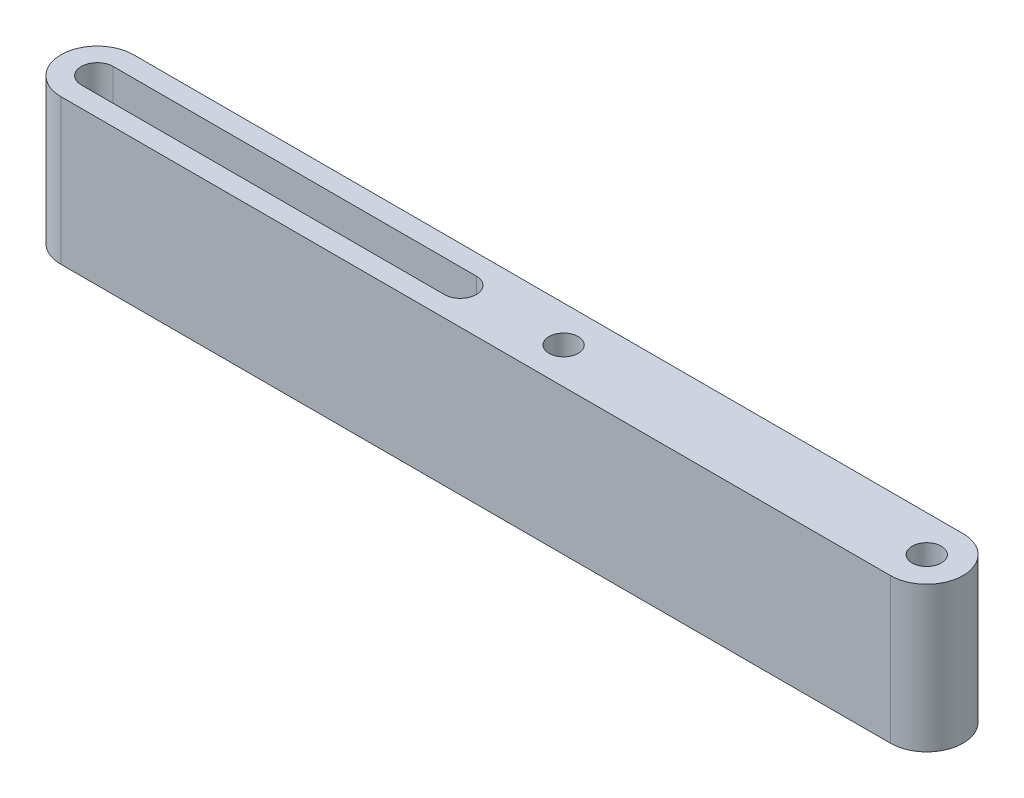
ISO-10303-21;
HEADER;
FILE_DESCRIPTION(('STEP AP214'),'2;1');
FILE_NAME('part.step','',(''),(''),'','','');
FILE_SCHEMA(('AUTOMOTIVE_DESIGN { 1 0 10303 214 1 1 1 1 }'));
ENDSEC;
DATA;
#1=APPLICATION_CONTEXT('core data for automotive mechanical design processes');
#2=APPLICATION_PROTOCOL_DEFINITION('international standard','automotive_design',2000,#1);
#3=PRODUCT_CONTEXT('',#1,'mechanical');
#4=PRODUCT('Part','Part','',(#3));
#5=PRODUCT_RELATED_PRODUCT_CATEGORY('part','',(#4));
#6=PRODUCT_DEFINITION_FORMATION('','',#4);
#7=PRODUCT_DEFINITION_CONTEXT('part definition',#1,'design');
#8=PRODUCT_DEFINITION('design','',#6,#7);
#9=PRODUCT_DEFINITION_SHAPE('','',#8);
#10=(LENGTH_UNIT() NAMED_UNIT(*) SI_UNIT(.MILLI.,.METRE.));
#11=(NAMED_UNIT(*) PLANE_ANGLE_UNIT() SI_UNIT($,.RADIAN.));
#12=(NAMED_UNIT(*) SI_UNIT($,.STERADIAN.) SOLID_ANGLE_UNIT());
#13=UNCERTAINTY_MEASURE_WITH_UNIT(LENGTH_MEASURE(1.E-05),#10,'distance_accuracy_value','');
#14=(GEOMETRIC_REPRESENTATION_CONTEXT(3) GLOBAL_UNCERTAINTY_ASSIGNED_CONTEXT((#13)) GLOBAL_UNIT_ASSIGNED_CONTEXT((#10,
#11,#12)) REPRESENTATION_CONTEXT('',''));
#15=CARTESIAN_POINT('',(0.,0.,0.));
#16=DIRECTION('',(0.,0.,1.));
#17=DIRECTION('',(1.,0.,0.));
#18=AXIS2_PLACEMENT_3D('',#15,#16,#17);
#19=CARTESIAN_POINT('',(-31.75,170.972296099361,44.45));
#20=DIRECTION('',(0.,-1.,0.));
#21=DIRECTION('',(0.,0.,-1.));
#22=AXIS2_PLACEMENT_3D('',#19,#20,#21);
#23=CYLINDRICAL_SURFACE('',#22,2.55270000000003);
#24=CARTESIAN_POINT('',(-31.75,-12.7,44.45));
#25=DIRECTION('',(0.,1.,0.));
#26=DIRECTION('',(0.,0.,1.));
#27=AXIS2_PLACEMENT_3D('',#24,#25,#26);
#28=CIRCLE('',#27,2.55270000000003);
#29=CARTESIAN_POINT('',(-31.75,-12.7,41.8973));
#30=VERTEX_POINT('',#29);
#31=EDGE_CURVE('E179',#30,#30,#28,.T.);
#32=CARTESIAN_POINT('',(-31.75,12.7,44.45));
#33=DIRECTION('',(0.,1.,0.));
#34=DIRECTION('',(0.,0.,1.));
#35=AXIS2_PLACEMENT_3D('',#32,#33,#34);
#36=CIRCLE('',#35,2.55270000000003);
#37=CARTESIAN_POINT('',(-31.75,12.7,41.8973));
#38=VERTEX_POINT('',#37);
#39=EDGE_CURVE('E110',#38,#38,#36,.T.);
#40=CARTESIAN_POINT('',(-31.75,-12.7,41.8973));
#41=CARTESIAN_POINT('',(-31.75,-12.4354166666667,41.8973));
#42=CARTESIAN_POINT('',(-31.75,-12.1708333333333,41.8973));
#43=CARTESIAN_POINT('',(-31.75,-11.6416666666667,41.8973));
#44=CARTESIAN_POINT('',(-31.75,-11.3770833333333,41.8973));
#45=CARTESIAN_POINT('',(-31.75,-10.8479166666667,41.8973));
#46=CARTESIAN_POINT('',(-31.75,-10.5833333333333,41.8973));
#47=CARTESIAN_POINT('',(-31.75,-10.0541666666667,41.8973));
#48=CARTESIAN_POINT('',(-31.75,-9.78958333333333,41.8973));
#49=CARTESIAN_POINT('',(-31.75,-9.26041666666667,41.8973));
#50=CARTESIAN_POINT('',(-31.75,-8.99583333333333,41.8973));
#51=CARTESIAN_POINT('',(-31.75,-8.46666666666666,41.8973));
#52=CARTESIAN_POINT('',(-31.75,-8.20208333333332,41.8973));
#53=CARTESIAN_POINT('',(-31.75,-7.67291666666666,41.8973));
#54=CARTESIAN_POINT('',(-31.75,-7.40833333333333,41.8973));
#55=CARTESIAN_POINT('',(-31.75,-6.87916666666667,41.8973));
#56=CARTESIAN_POINT('',(-31.75,-6.61458333333333,41.8973));
#57=CARTESIAN_POINT('',(-31.75,-6.08541666666666,41.8973));
#58=CARTESIAN_POINT('',(-31.75,-5.82083333333332,41.8973));
#59=CARTESIAN_POINT('',(-31.75,-5.29166666666666,41.8973));
#60=CARTESIAN_POINT('',(-31.75,-5.02708333333333,41.8973));
#61=CARTESIAN_POINT('',(-31.75,-4.49791666666667,41.8973));
#62=CARTESIAN_POINT('',(-31.75,-4.23333333333333,41.8973));
#63=CARTESIAN_POINT('',(-31.75,-3.70416666666666,41.8973));
#64=CARTESIAN_POINT('',(-31.75,-3.43958333333332,41.8973));
#65=CARTESIAN_POINT('',(-31.75,-2.91041666666666,41.8973));
#66=CARTESIAN_POINT('',(-31.75,-2.64583333333333,41.8973));
#67=CARTESIAN_POINT('',(-31.75,-2.11666666666666,41.8973));
#68=CARTESIAN_POINT('',(-31.75,-1.85208333333333,41.8973));
#69=CARTESIAN_POINT('',(-31.75,-1.32291666666666,41.8973));
#70=CARTESIAN_POINT('',(-31.75,-1.05833333333334,41.8973));
#71=CARTESIAN_POINT('',(-31.75,-0.529166666666673,41.8973));
#72=CARTESIAN_POINT('',(-31.75,-0.264583333333337,41.8973));
#73=CARTESIAN_POINT('',(-31.75,0.264583333333337,41.8973));
#74=CARTESIAN_POINT('',(-31.75,0.529166666666673,41.8973));
#75=CARTESIAN_POINT('',(-31.75,1.05833333333334,41.8973));
#76=CARTESIAN_POINT('',(-31.75,1.32291666666666,41.8973));
#77=CARTESIAN_POINT('',(-31.75,1.85208333333333,41.8973));
#78=CARTESIAN_POINT('',(-31.75,2.11666666666666,41.8973));
#79=CARTESIAN_POINT('',(-31.75,2.64583333333333,41.8973));
#80=CARTESIAN_POINT('',(-31.75,2.91041666666666,41.8973));
#81=CARTESIAN_POINT('',(-31.75,3.43958333333332,41.8973));
#82=CARTESIAN_POINT('',(-31.75,3.70416666666666,41.8973));
#83=CARTESIAN_POINT('',(-31.75,4.23333333333333,41.8973));
#84=CARTESIAN_POINT('',(-31.75,4.49791666666667,41.8973));
#85=CARTESIAN_POINT('',(-31.75,5.02708333333333,41.8973));
#86=CARTESIAN_POINT('',(-31.75,5.29166666666666,41.8973));
#87=CARTESIAN_POINT('',(-31.75,5.82083333333332,41.8973));
#88=CARTESIAN_POINT('',(-31.75,6.08541666666666,41.8973));
#89=CARTESIAN_POINT('',(-31.75,6.61458333333333,41.8973));
#90=CARTESIAN_POINT('',(-31.75,6.87916666666667,41.8973));
#91=CARTESIAN_POINT('',(-31.75,7.40833333333333,41.8973));
#92=CARTESIAN_POINT('',(-31.75,7.67291666666666,41.8973));
#93=CARTESIAN_POINT('',(-31.75,8.20208333333332,41.8973));
#94=CARTESIAN_POINT('',(-31.75,8.46666666666666,41.8973));
#95=CARTESIAN_POINT('',(-31.75,8.99583333333333,41.8973));
#96=CARTESIAN_POINT('',(-31.75,9.26041666666667,41.8973));
#97=CARTESIAN_POINT('',(-31.75,9.78958333333333,41.8973));
#98=CARTESIAN_POINT('',(-31.75,10.0541666666667,41.8973));
#99=CARTESIAN_POINT('',(-31.75,10.5833333333333,41.8973));
#100=CARTESIAN_POINT('',(-31.75,10.8479166666667,41.8973));
#101=CARTESIAN_POINT('',(-31.75,11.3770833333333,41.8973));
#102=CARTESIAN_POINT('',(-31.75,11.6416666666667,41.8973));
#103=CARTESIAN_POINT('',(-31.75,12.1708333333333,41.8973));
#104=CARTESIAN_POINT('',(-31.75,12.4354166666667,41.8973));
#105=CARTESIAN_POINT('',(-31.75,12.7,41.8973));
#106=B_SPLINE_CURVE_WITH_KNOTS('',3,(#40,#41,#42,#43,#44,#45,#46,#47,#48,#49,#50,#51,#52,#53,
#54,#55,#56,#57,#58,#59,#60,#61,#62,#63,#64,#65,#66,#67,#68,#69,#70,#71,#72,#73,#74,#75,#76,#77,
#78,#79,#80,#81,#82,#83,#84,#85,#86,#87,#88,#89,#90,#91,#92,#93,#94,#95,#96,#97,#98,#99,#100,
#101,#102,#103,#104,#105),.UNSPECIFIED.,.F.,.F.,(4,2,2,2,2,2,2,2,2,2,2,2,2,2,2,2,2,2,2,2,2,2,2,
2,2,2,2,2,2,2,2,2,4),(0.,0.79375000000001,1.58749999999999,2.38125,3.17499999999998,
3.96874999999999,4.7625,5.55624999999998,6.34999999999999,7.14375,7.93749999999999,8.73125,
9.52500000000001,10.31875,11.1125,11.90625,12.7,13.49375,14.2875,15.08125,15.875,16.66875,
17.4625,18.25625,19.05,19.84375,20.6375,21.43125,22.225,23.01875,23.8125,24.60625,25.4),.UNSPECIFIED.);
#107=EDGE_CURVE('BSEAM39',#30,#38,#106,.T.);
#108=ORIENTED_EDGE('',*,*,#31,.F.);
#109=ORIENTED_EDGE('',*,*,#39,.T.);
#110=ORIENTED_EDGE('',*,*,#107,.T.);
#111=ORIENTED_EDGE('',*,*,#107,.F.);
#112=EDGE_LOOP('',(#108,#110,#109,#111));
#113=FACE_BOUND('',#112,.T.);
#114=ADVANCED_FACE('F39',(#113),#23,.F.);
#115=CARTESIAN_POINT('',(-49.81194,170.972296099361,47.244));
#116=DIRECTION('',(0.,0.,-1.));
#117=DIRECTION('',(-1.,0.,0.));
#118=AXIS2_PLACEMENT_3D('',#115,#116,#117);
#119=PLANE('',#118);
#120=DIRECTION('',(0.,-1.,0.));
#121=VECTOR('',#120,1.);
#122=CARTESIAN_POINT('',(-113.31194,170.972296099361,47.244));
#123=LINE('',#122,#121);
#124=CARTESIAN_POINT('',(-113.31194,12.7,47.244));
#125=VERTEX_POINT('',#124);
#126=CARTESIAN_POINT('',(-113.31194,-12.7,47.244));
#127=VERTEX_POINT('',#126);
#128=EDGE_CURVE('E115',#125,#127,#123,.T.);
#129=ORIENTED_EDGE('',*,*,#128,.F.);
#130=DIRECTION('',(1.,0.,0.));
#131=VECTOR('',#130,1.);
#132=CARTESIAN_POINT('',(-49.81194,12.7,47.244));
#133=LINE('',#132,#131);
#134=CARTESIAN_POINT('',(-49.81194,12.7,47.244));
#135=VERTEX_POINT('',#134);
#136=EDGE_CURVE('E102',#125,#135,#133,.T.);
#137=ORIENTED_EDGE('',*,*,#136,.T.);
#138=DIRECTION('',(0.,-1.,0.));
#139=VECTOR('',#138,1.);
#140=CARTESIAN_POINT('',(-49.81194,170.972296099361,47.244));
#141=LINE('',#140,#139);
#142=CARTESIAN_POINT('',(-49.81194,-12.7,47.244));
#143=VERTEX_POINT('',#142);
#144=EDGE_CURVE('E125',#135,#143,#141,.T.);
#145=ORIENTED_EDGE('',*,*,#144,.T.);
#146=DIRECTION('',(1.,0.,0.));
#147=VECTOR('',#146,1.);
#148=CARTESIAN_POINT('',(-49.81194,-12.7,47.244));
#149=LINE('',#148,#147);
#150=EDGE_CURVE('E123',#127,#143,#149,.T.);
#151=ORIENTED_EDGE('',*,*,#150,.F.);
#152=EDGE_LOOP('',(#129,#137,#145,#151));
#153=FACE_BOUND('',#152,.T.);
#154=ADVANCED_FACE('F121',(#153),#119,.T.);
#155=CARTESIAN_POINT('',(-113.31194,170.972296099361,44.45));
#156=DIRECTION('',(0.,-1.,0.));
#157=DIRECTION('',(0.,0.,-1.));
#158=AXIS2_PLACEMENT_3D('',#155,#156,#157);
#159=CYLINDRICAL_SURFACE('',#158,2.79400000000001);
#160=DIRECTION('',(0.,-1.,0.));
#161=VECTOR('',#160,1.);
#162=CARTESIAN_POINT('',(-113.31194,170.972296099361,41.656));
#163=LINE('',#162,#161);
#164=CARTESIAN_POINT('',(-113.31194,12.7,41.656));
#165=VERTEX_POINT('',#164);
#166=CARTESIAN_POINT('',(-113.31194,-12.7,41.656));
#167=VERTEX_POINT('',#166);
#168=EDGE_CURVE('E117',#165,#167,#163,.T.);
#169=ORIENTED_EDGE('',*,*,#168,.F.);
#170=CARTESIAN_POINT('',(-113.31194,12.7,44.45));
#171=DIRECTION('',(0.,1.,0.));
#172=DIRECTION('',(0.,0.,1.));
#173=AXIS2_PLACEMENT_3D('',#170,#171,#172);
#174=CIRCLE('',#173,2.79400000000001);
#175=EDGE_CURVE('E106',#165,#125,#174,.T.);
#176=ORIENTED_EDGE('',*,*,#175,.T.);
#177=ORIENTED_EDGE('',*,*,#128,.T.);
#178=CARTESIAN_POINT('',(-113.31194,-12.7,44.45));
#179=DIRECTION('',(0.,1.,0.));
#180=DIRECTION('',(0.,0.,1.));
#181=AXIS2_PLACEMENT_3D('',#178,#179,#180);
#182=CIRCLE('',#181,2.79400000000001);
#183=EDGE_CURVE('E188',#167,#127,#182,.T.);
#184=ORIENTED_EDGE('',*,*,#183,.F.);
#185=EDGE_LOOP('',(#169,#176,#177,#184));
#186=FACE_BOUND('',#185,.T.);
#187=ADVANCED_FACE('F113',(#186),#159,.F.);
#188=CARTESIAN_POINT('',(-49.81194,170.972296099361,41.656));
#189=DIRECTION('',(0.,0.,1.));
#190=DIRECTION('',(1.,0.,0.));
#191=AXIS2_PLACEMENT_3D('',#188,#189,#190);
#192=PLANE('',#191);
#193=DIRECTION('',(0.,-1.,0.));
#194=VECTOR('',#193,1.);
#195=CARTESIAN_POINT('',(-49.81194,170.972296099361,41.656));
#196=LINE('',#195,#194);
#197=CARTESIAN_POINT('',(-49.81194,12.7,41.656));
#198=VERTEX_POINT('',#197);
#199=CARTESIAN_POINT('',(-49.81194,-12.7,41.656));
#200=VERTEX_POINT('',#199);
#201=EDGE_CURVE('E127',#198,#200,#196,.T.);
#202=ORIENTED_EDGE('',*,*,#201,.F.);
#203=DIRECTION('',(-1.,0.,0.));
#204=VECTOR('',#203,1.);
#205=CARTESIAN_POINT('',(-49.81194,12.7,41.656));
#206=LINE('',#205,#204);
#207=EDGE_CURVE('E119',#198,#165,#206,.T.);
#208=ORIENTED_EDGE('',*,*,#207,.T.);
#209=ORIENTED_EDGE('',*,*,#168,.T.);
#210=DIRECTION('',(-1.,0.,0.));
#211=VECTOR('',#210,1.);
#212=CARTESIAN_POINT('',(-49.81194,-12.7,41.656));
#213=LINE('',#212,#211);
#214=EDGE_CURVE('E185',#200,#167,#213,.T.);
#215=ORIENTED_EDGE('',*,*,#214,.F.);
#216=EDGE_LOOP('',(#202,#208,#209,#215));
#217=FACE_BOUND('',#216,.T.);
#218=ADVANCED_FACE('F194',(#217),#192,.T.);
#219=CARTESIAN_POINT('',(-49.81194,170.972296099361,44.45));
#220=DIRECTION('',(0.,-1.,0.));
#221=DIRECTION('',(0.,0.,-1.));
#222=AXIS2_PLACEMENT_3D('',#219,#220,#221);
#223=CYLINDRICAL_SURFACE('',#222,2.794);
#224=ORIENTED_EDGE('',*,*,#144,.F.);
#225=CARTESIAN_POINT('',(-49.81194,12.7,44.45));
#226=DIRECTION('',(0.,1.,0.));
#227=DIRECTION('',(0.,0.,1.));
#228=AXIS2_PLACEMENT_3D('',#225,#226,#227);
#229=CIRCLE('',#228,2.794);
#230=EDGE_CURVE('E63',#135,#198,#229,.T.);
#231=ORIENTED_EDGE('',*,*,#230,.T.);
#232=ORIENTED_EDGE('',*,*,#201,.T.);
#233=CARTESIAN_POINT('',(-49.81194,-12.7,44.45));
#234=DIRECTION('',(0.,1.,0.));
#235=DIRECTION('',(0.,0.,1.));
#236=AXIS2_PLACEMENT_3D('',#233,#234,#235);
#237=CIRCLE('',#236,2.794);
#238=EDGE_CURVE('E182',#143,#200,#237,.T.);
#239=ORIENTED_EDGE('',*,*,#238,.F.);
#240=EDGE_LOOP('',(#224,#231,#232,#239));
#241=FACE_BOUND('',#240,.T.);
#242=ADVANCED_FACE('F226',(#241),#223,.F.);
#243=CARTESIAN_POINT('',(31.75,170.972296099361,50.8));
#244=DIRECTION('',(0.,0.,-1.));
#245=DIRECTION('',(-1.,0.,0.));
#246=AXIS2_PLACEMENT_3D('',#243,#244,#245);
#247=PLANE('',#246);
#248=DIRECTION('',(1.,0.,0.));
#249=VECTOR('',#248,1.);
#250=CARTESIAN_POINT('',(31.75,12.7,50.8));
#251=LINE('',#250,#249);
#252=CARTESIAN_POINT('',(-113.31194,12.7,50.8000000000001));
#253=VERTEX_POINT('',#252);
#254=CARTESIAN_POINT('',(31.75,12.7,50.8));
#255=VERTEX_POINT('',#254);
#256=EDGE_CURVE('E166',#253,#255,#251,.T.);
#257=ORIENTED_EDGE('',*,*,#256,.F.);
#258=DIRECTION('',(0.,-1.,0.));
#259=VECTOR('',#258,1.);
#260=CARTESIAN_POINT('',(-113.31194,170.972296099361,50.8000000000001));
#261=LINE('',#260,#259);
#262=CARTESIAN_POINT('',(-113.31194,-12.7,50.8000000000001));
#263=VERTEX_POINT('',#262);
#264=EDGE_CURVE('E55',#253,#263,#261,.T.);
#265=ORIENTED_EDGE('',*,*,#264,.T.);
#266=DIRECTION('',(1.,0.,0.));
#267=VECTOR('',#266,1.);
#268=CARTESIAN_POINT('',(31.75,-12.7,50.8));
#269=LINE('',#268,#267);
#270=CARTESIAN_POINT('',(31.75,-12.7,50.8));
#271=VERTEX_POINT('',#270);
#272=EDGE_CURVE('E141',#263,#271,#269,.T.);
#273=ORIENTED_EDGE('',*,*,#272,.T.);
#274=DIRECTION('',(0.,-1.,0.));
#275=VECTOR('',#274,1.);
#276=CARTESIAN_POINT('',(31.75,170.972296099361,50.8));
#277=LINE('',#276,#275);
#278=EDGE_CURVE('E144',#255,#271,#277,.T.);
#279=ORIENTED_EDGE('',*,*,#278,.F.);
#280=EDGE_LOOP('',(#257,#265,#273,#279));
#281=FACE_BOUND('',#280,.T.);
#282=ADVANCED_FACE('F163',(#281),#247,.F.);
#283=CARTESIAN_POINT('',(-113.31194,170.972296099361,44.45));
#284=DIRECTION('',(0.,-1.,0.));
#285=DIRECTION('',(0.,0.,-1.));
#286=AXIS2_PLACEMENT_3D('',#283,#284,#285);
#287=CYLINDRICAL_SURFACE('',#286,6.35000000000004);
#288=CARTESIAN_POINT('',(-113.31194,12.7,44.45));
#289=DIRECTION('',(0.,1.,0.));
#290=DIRECTION('',(0.,0.,1.));
#291=AXIS2_PLACEMENT_3D('',#288,#289,#290);
#292=CIRCLE('',#291,6.35000000000004);
#293=CARTESIAN_POINT('',(-113.31194,12.7,38.1));
#294=VERTEX_POINT('',#293);
#295=EDGE_CURVE('E152',#294,#253,#292,.T.);
#296=ORIENTED_EDGE('',*,*,#295,.F.);
#297=DIRECTION('',(0.,-1.,0.));
#298=VECTOR('',#297,1.);
#299=CARTESIAN_POINT('',(-113.31194,170.972296099361,38.1));
#300=LINE('',#299,#298);
#301=CARTESIAN_POINT('',(-113.31194,-12.7,38.1));
#302=VERTEX_POINT('',#301);
#303=EDGE_CURVE('E48',#294,#302,#300,.T.);
#304=ORIENTED_EDGE('',*,*,#303,.T.);
#305=CARTESIAN_POINT('',(-113.31194,-12.7,44.45));
#306=DIRECTION('',(0.,1.,0.));
#307=DIRECTION('',(0.,0.,1.));
#308=AXIS2_PLACEMENT_3D('',#305,#306,#307);
#309=CIRCLE('',#308,6.35000000000004);
#310=EDGE_CURVE('E139',#302,#263,#309,.T.);
#311=ORIENTED_EDGE('',*,*,#310,.T.);
#312=ORIENTED_EDGE('',*,*,#264,.F.);
#313=EDGE_LOOP('',(#296,#304,#311,#312));
#314=FACE_BOUND('',#313,.T.);
#315=ADVANCED_FACE('F148',(#314),#287,.T.);
#316=CARTESIAN_POINT('',(31.75,170.972296099361,38.1));
#317=DIRECTION('',(0.,0.,1.));
#318=DIRECTION('',(1.,0.,0.));
#319=AXIS2_PLACEMENT_3D('',#316,#317,#318);
#320=PLANE('',#319);
#321=DIRECTION('',(-1.,0.,0.));
#322=VECTOR('',#321,1.);
#323=CARTESIAN_POINT('',(31.75,12.7,38.1));
#324=LINE('',#323,#322);
#325=CARTESIAN_POINT('',(31.75,12.7,38.1));
#326=VERTEX_POINT('',#325);
#327=EDGE_CURVE('E169',#326,#294,#324,.T.);
#328=ORIENTED_EDGE('',*,*,#327,.F.);
#329=DIRECTION('',(0.,-1.,0.));
#330=VECTOR('',#329,1.);
#331=CARTESIAN_POINT('',(31.75,170.972296099361,38.1));
#332=LINE('',#331,#330);
#333=CARTESIAN_POINT('',(31.75,-12.7,38.1));
#334=VERTEX_POINT('',#333);
#335=EDGE_CURVE('E11',#326,#334,#332,.T.);
#336=ORIENTED_EDGE('',*,*,#335,.T.);
#337=DIRECTION('',(-1.,0.,0.));
#338=VECTOR('',#337,1.);
#339=CARTESIAN_POINT('',(31.75,-12.7,38.1));
#340=LINE('',#339,#338);
#341=EDGE_CURVE('E136',#334,#302,#340,.T.);
#342=ORIENTED_EDGE('',*,*,#341,.T.);
#343=ORIENTED_EDGE('',*,*,#303,.F.);
#344=EDGE_LOOP('',(#328,#336,#342,#343));
#345=FACE_BOUND('',#344,.T.);
#346=ADVANCED_FACE('F156',(#345),#320,.F.);
#347=CARTESIAN_POINT('',(31.75,170.972296099361,44.45));
#348=DIRECTION('',(0.,-1.,0.));
#349=DIRECTION('',(0.,0.,-1.));
#350=AXIS2_PLACEMENT_3D('',#347,#348,#349);
#351=CYLINDRICAL_SURFACE('',#350,6.35000000000003);
#352=CARTESIAN_POINT('',(31.75,12.7,44.45));
#353=DIRECTION('',(0.,1.,0.));
#354=DIRECTION('',(0.,0.,1.));
#355=AXIS2_PLACEMENT_3D('',#352,#353,#354);
#356=CIRCLE('',#355,6.35000000000003);
#357=EDGE_CURVE('E171',#255,#326,#356,.T.);
#358=ORIENTED_EDGE('',*,*,#357,.F.);
#359=ORIENTED_EDGE('',*,*,#278,.T.);
#360=CARTESIAN_POINT('',(31.75,-12.7,44.45));
#361=DIRECTION('',(0.,1.,0.));
#362=DIRECTION('',(0.,0.,1.));
#363=AXIS2_PLACEMENT_3D('',#360,#361,#362);
#364=CIRCLE('',#363,6.35000000000003);
#365=EDGE_CURVE('E133',#271,#334,#364,.T.);
#366=ORIENTED_EDGE('',*,*,#365,.T.);
#367=ORIENTED_EDGE('',*,*,#335,.F.);
#368=EDGE_LOOP('',(#358,#359,#366,#367));
#369=FACE_BOUND('',#368,.T.);
#370=ADVANCED_FACE('F41',(#369),#351,.T.);
#371=CARTESIAN_POINT('',(31.75,-12.7,44.45));
#372=DIRECTION('',(0.,1.,0.));
#373=DIRECTION('',(0.,0.,1.));
#374=AXIS2_PLACEMENT_3D('',#371,#372,#373);
#375=PLANE('',#374);
#376=ORIENTED_EDGE('',*,*,#365,.F.);
#377=ORIENTED_EDGE('',*,*,#272,.F.);
#378=ORIENTED_EDGE('',*,*,#310,.F.);
#379=ORIENTED_EDGE('',*,*,#341,.F.);
#380=EDGE_LOOP('',(#376,#377,#378,#379));
#381=FACE_BOUND('',#380,.T.);
#382=ORIENTED_EDGE('',*,*,#238,.T.);
#383=ORIENTED_EDGE('',*,*,#214,.T.);
#384=ORIENTED_EDGE('',*,*,#183,.T.);
#385=ORIENTED_EDGE('',*,*,#150,.T.);
#386=EDGE_LOOP('',(#382,#383,#384,#385));
#387=FACE_BOUND('',#386,.T.);
#388=ORIENTED_EDGE('',*,*,#31,.T.);
#389=EDGE_LOOP('',(#388));
#390=FACE_BOUND('',#389,.T.);
#391=CARTESIAN_POINT('',(31.75,-12.7,44.45));
#392=DIRECTION('',(0.,1.,0.));
#393=DIRECTION('',(0.,0.,1.));
#394=AXIS2_PLACEMENT_3D('',#391,#392,#393);
#395=CIRCLE('',#394,2.5527);
#396=CARTESIAN_POINT('',(31.75,-12.7,41.8973));
#397=VERTEX_POINT('',#396);
#398=EDGE_CURVE('E176',#397,#397,#395,.T.);
#399=ORIENTED_EDGE('',*,*,#398,.T.);
#400=EDGE_LOOP('',(#399));
#401=FACE_BOUND('',#400,.T.);
#402=ADVANCED_FACE('F160',(#381,#387,#390,#401),#375,.F.);
#403=CARTESIAN_POINT('',(31.75,170.972296099361,44.45));
#404=DIRECTION('',(0.,-1.,0.));
#405=DIRECTION('',(0.,0.,-1.));
#406=AXIS2_PLACEMENT_3D('',#403,#404,#405);
#407=CYLINDRICAL_SURFACE('',#406,2.5527);
#408=CARTESIAN_POINT('',(31.75,12.7,44.45));
#409=DIRECTION('',(0.,1.,0.));
#410=DIRECTION('',(0.,0.,1.));
#411=AXIS2_PLACEMENT_3D('',#408,#409,#410);
#412=CIRCLE('',#411,2.5527);
#413=CARTESIAN_POINT('',(31.75,12.7,41.8973));
#414=VERTEX_POINT('',#413);
#415=EDGE_CURVE('E43',#414,#414,#412,.T.);
#416=CARTESIAN_POINT('',(31.75,-12.7,41.8973));
#417=CARTESIAN_POINT('',(31.75,-12.4354166666667,41.8973));
#418=CARTESIAN_POINT('',(31.75,-12.1708333333333,41.8973));
#419=CARTESIAN_POINT('',(31.75,-11.6416666666667,41.8973));
#420=CARTESIAN_POINT('',(31.75,-11.3770833333333,41.8973));
#421=CARTESIAN_POINT('',(31.75,-10.8479166666667,41.8973));
#422=CARTESIAN_POINT('',(31.75,-10.5833333333333,41.8973));
#423=CARTESIAN_POINT('',(31.75,-10.0541666666667,41.8973));
#424=CARTESIAN_POINT('',(31.75,-9.78958333333333,41.8973));
#425=CARTESIAN_POINT('',(31.75,-9.26041666666667,41.8973));
#426=CARTESIAN_POINT('',(31.75,-8.99583333333333,41.8973));
#427=CARTESIAN_POINT('',(31.75,-8.46666666666666,41.8973));
#428=CARTESIAN_POINT('',(31.75,-8.20208333333332,41.8973));
#429=CARTESIAN_POINT('',(31.75,-7.67291666666666,41.8973));
#430=CARTESIAN_POINT('',(31.75,-7.40833333333333,41.8973));
#431=CARTESIAN_POINT('',(31.75,-6.87916666666667,41.8973));
#432=CARTESIAN_POINT('',(31.75,-6.61458333333333,41.8973));
#433=CARTESIAN_POINT('',(31.75,-6.08541666666666,41.8973));
#434=CARTESIAN_POINT('',(31.75,-5.82083333333332,41.8973));
#435=CARTESIAN_POINT('',(31.75,-5.29166666666666,41.8973));
#436=CARTESIAN_POINT('',(31.75,-5.02708333333333,41.8973));
#437=CARTESIAN_POINT('',(31.75,-4.49791666666667,41.8973));
#438=CARTESIAN_POINT('',(31.75,-4.23333333333333,41.8973));
#439=CARTESIAN_POINT('',(31.75,-3.70416666666666,41.8973));
#440=CARTESIAN_POINT('',(31.75,-3.43958333333332,41.8973));
#441=CARTESIAN_POINT('',(31.75,-2.91041666666666,41.8973));
#442=CARTESIAN_POINT('',(31.75,-2.64583333333333,41.8973));
#443=CARTESIAN_POINT('',(31.75,-2.11666666666666,41.8973));
#444=CARTESIAN_POINT('',(31.75,-1.85208333333333,41.8973));
#445=CARTESIAN_POINT('',(31.75,-1.32291666666666,41.8973));
#446=CARTESIAN_POINT('',(31.75,-1.05833333333334,41.8973));
#447=CARTESIAN_POINT('',(31.75,-0.529166666666673,41.8973));
#448=CARTESIAN_POINT('',(31.75,-0.264583333333337,41.8973));
#449=CARTESIAN_POINT('',(31.75,0.264583333333337,41.8973));
#450=CARTESIAN_POINT('',(31.75,0.529166666666673,41.8973));
#451=CARTESIAN_POINT('',(31.75,1.05833333333334,41.8973));
#452=CARTESIAN_POINT('',(31.75,1.32291666666666,41.8973));
#453=CARTESIAN_POINT('',(31.75,1.85208333333333,41.8973));
#454=CARTESIAN_POINT('',(31.75,2.11666666666666,41.8973));
#455=CARTESIAN_POINT('',(31.75,2.64583333333333,41.8973));
#456=CARTESIAN_POINT('',(31.75,2.91041666666666,41.8973));
#457=CARTESIAN_POINT('',(31.75,3.43958333333332,41.8973));
#458=CARTESIAN_POINT('',(31.75,3.70416666666666,41.8973));
#459=CARTESIAN_POINT('',(31.75,4.23333333333333,41.8973));
#460=CARTESIAN_POINT('',(31.75,4.49791666666667,41.8973));
#461=CARTESIAN_POINT('',(31.75,5.02708333333333,41.8973));
#462=CARTESIAN_POINT('',(31.75,5.29166666666666,41.8973));
#463=CARTESIAN_POINT('',(31.75,5.82083333333332,41.8973));
#464=CARTESIAN_POINT('',(31.75,6.08541666666666,41.8973));
#465=CARTESIAN_POINT('',(31.75,6.61458333333333,41.8973));
#466=CARTESIAN_POINT('',(31.75,6.87916666666667,41.8973));
#467=CARTESIAN_POINT('',(31.75,7.40833333333333,41.8973));
#468=CARTESIAN_POINT('',(31.75,7.67291666666666,41.8973));
#469=CARTESIAN_POINT('',(31.75,8.20208333333332,41.8973));
#470=CARTESIAN_POINT('',(31.75,8.46666666666666,41.8973));
#471=CARTESIAN_POINT('',(31.75,8.99583333333333,41.8973));
#472=CARTESIAN_POINT('',(31.75,9.26041666666667,41.8973));
#473=CARTESIAN_POINT('',(31.75,9.78958333333333,41.8973));
#474=CARTESIAN_POINT('',(31.75,10.0541666666667,41.8973));
#475=CARTESIAN_POINT('',(31.75,10.5833333333333,41.8973));
#476=CARTESIAN_POINT('',(31.75,10.8479166666667,41.8973));
#477=CARTESIAN_POINT('',(31.75,11.3770833333333,41.8973));
#478=CARTESIAN_POINT('',(31.75,11.6416666666667,41.8973));
#479=CARTESIAN_POINT('',(31.75,12.1708333333333,41.8973));
#480=CARTESIAN_POINT('',(31.75,12.4354166666667,41.8973));
#481=CARTESIAN_POINT('',(31.75,12.7,41.8973));
#482=B_SPLINE_CURVE_WITH_KNOTS('',3,(#416,#417,#418,#419,#420,#421,#422,#423,#424,#425,#426,
#427,#428,#429,#430,#431,#432,#433,#434,#435,#436,#437,#438,#439,#440,#441,#442,#443,#444,#445,
#446,#447,#448,#449,#450,#451,#452,#453,#454,#455,#456,#457,#458,#459,#460,#461,#462,#463,#464,
#465,#466,#467,#468,#469,#470,#471,#472,#473,#474,#475,#476,#477,#478,#479,#480,#481),
.UNSPECIFIED.,.F.,.F.,(4,2,2,2,2,2,2,2,2,2,2,2,2,2,2,2,2,2,2,2,2,2,2,2,2,2,2,2,2,2,2,2,4),(0.,
0.79375000000001,1.58749999999999,2.38125,3.17499999999998,3.96874999999999,4.7625,
5.55624999999998,6.34999999999999,7.14375,7.93749999999999,8.73125,9.52500000000001,10.31875,
11.1125,11.90625,12.7,13.49375,14.2875,15.08125,15.875,16.66875,17.4625,18.25625,19.05,19.84375,
20.6375,21.43125,22.225,23.01875,23.8125,24.60625,25.4),.UNSPECIFIED.);
#483=EDGE_CURVE('BSEAM203',#397,#414,#482,.T.);
#484=ORIENTED_EDGE('',*,*,#398,.F.);
#485=ORIENTED_EDGE('',*,*,#415,.T.);
#486=ORIENTED_EDGE('',*,*,#483,.T.);
#487=ORIENTED_EDGE('',*,*,#483,.F.);
#488=EDGE_LOOP('',(#484,#486,#485,#487));
#489=FACE_BOUND('',#488,.T.);
#490=ADVANCED_FACE('F203',(#489),#407,.F.);
#491=CARTESIAN_POINT('',(0.,12.7,0.));
#492=DIRECTION('',(0.,1.,0.));
#493=DIRECTION('',(0.,0.,1.));
#494=AXIS2_PLACEMENT_3D('',#491,#492,#493);
#495=PLANE('',#494);
#496=ORIENTED_EDGE('',*,*,#415,.F.);
#497=EDGE_LOOP('',(#496));
#498=FACE_BOUND('',#497,.T.);
#499=ORIENTED_EDGE('',*,*,#39,.F.);
#500=EDGE_LOOP('',(#499));
#501=FACE_BOUND('',#500,.T.);
#502=ORIENTED_EDGE('',*,*,#230,.F.);
#503=ORIENTED_EDGE('',*,*,#136,.F.);
#504=ORIENTED_EDGE('',*,*,#175,.F.);
#505=ORIENTED_EDGE('',*,*,#207,.F.);
#506=EDGE_LOOP('',(#502,#503,#504,#505));
#507=FACE_BOUND('',#506,.T.);
#508=ORIENTED_EDGE('',*,*,#256,.T.);
#509=ORIENTED_EDGE('',*,*,#357,.T.);
#510=ORIENTED_EDGE('',*,*,#327,.T.);
#511=ORIENTED_EDGE('',*,*,#295,.T.);
#512=EDGE_LOOP('',(#508,#509,#510,#511));
#513=FACE_BOUND('',#512,.T.);
#514=ADVANCED_FACE('F104',(#498,#501,#507,#513),#495,.T.);
#515=CLOSED_SHELL('',(#114,#154,#187,#218,#242,#282,#315,#346,#370,#402,#490,#514));
#516=MANIFOLD_SOLID_BREP('B2',#515);
#517=ADVANCED_BREP_SHAPE_REPRESENTATION('',(#18,#516),#14);
#518=SHAPE_DEFINITION_REPRESENTATION(#9,#517);
ENDSEC;
END-ISO-10303-21;
